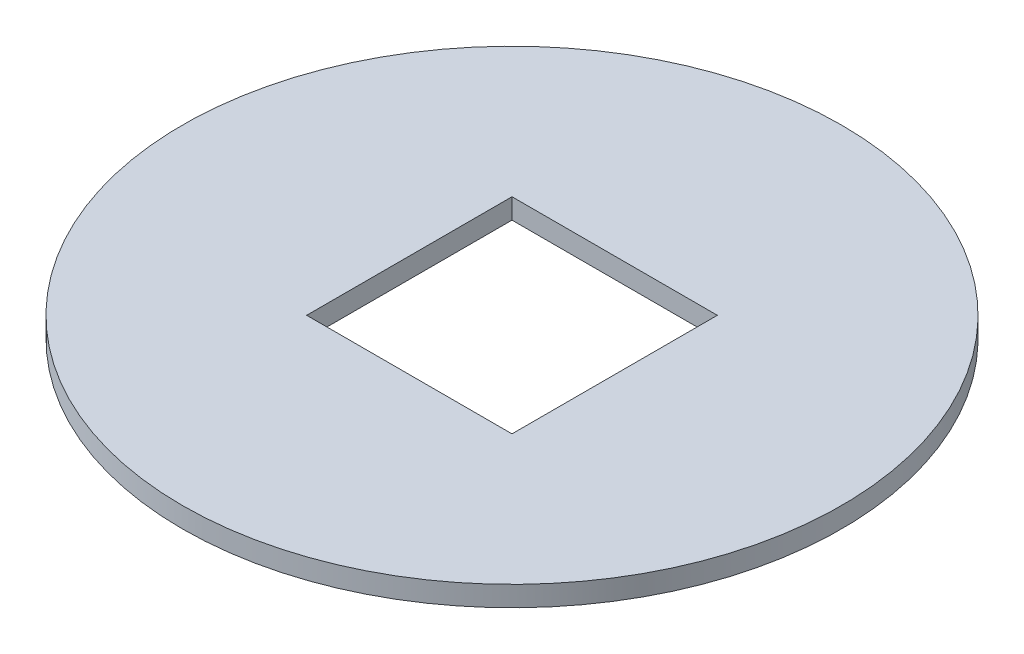
ISO-10303-21;
HEADER;
FILE_DESCRIPTION(('STEP AP214'),'2;1');
FILE_NAME('part.step','',(''),(''),'','','');
FILE_SCHEMA(('AUTOMOTIVE_DESIGN { 1 0 10303 214 1 1 1 1 }'));
ENDSEC;
DATA;
#1=APPLICATION_CONTEXT('core data for automotive mechanical design processes');
#2=APPLICATION_PROTOCOL_DEFINITION('international standard','automotive_design',2000,#1);
#3=PRODUCT_CONTEXT('',#1,'mechanical');
#4=PRODUCT('Part','Part','',(#3));
#5=PRODUCT_RELATED_PRODUCT_CATEGORY('part','',(#4));
#6=PRODUCT_DEFINITION_FORMATION('','',#4);
#7=PRODUCT_DEFINITION_CONTEXT('part definition',#1,'design');
#8=PRODUCT_DEFINITION('design','',#6,#7);
#9=PRODUCT_DEFINITION_SHAPE('','',#8);
#10=(LENGTH_UNIT() NAMED_UNIT(*) SI_UNIT(.MILLI.,.METRE.));
#11=(NAMED_UNIT(*) PLANE_ANGLE_UNIT() SI_UNIT($,.RADIAN.));
#12=(NAMED_UNIT(*) SI_UNIT($,.STERADIAN.) SOLID_ANGLE_UNIT());
#13=UNCERTAINTY_MEASURE_WITH_UNIT(LENGTH_MEASURE(1.E-05),#10,'distance_accuracy_value','');
#14=(GEOMETRIC_REPRESENTATION_CONTEXT(3) GLOBAL_UNCERTAINTY_ASSIGNED_CONTEXT((#13)) GLOBAL_UNIT_ASSIGNED_CONTEXT((#10,
#11,#12)) REPRESENTATION_CONTEXT('',''));
#15=CARTESIAN_POINT('',(0.,0.,0.));
#16=DIRECTION('',(0.,0.,1.));
#17=DIRECTION('',(1.,0.,0.));
#18=AXIS2_PLACEMENT_3D('',#15,#16,#17);
#19=CARTESIAN_POINT('',(172.,-198.124552093904,270.));
#20=DIRECTION('',(0.,-1.,0.));
#21=DIRECTION('',(0.,0.,-1.));
#22=AXIS2_PLACEMENT_3D('',#19,#20,#21);
#23=CYLINDRICAL_SURFACE('',#22,65.);
#24=CARTESIAN_POINT('',(172.,-198.124552093904,270.));
#25=DIRECTION('',(0.,1.,0.));
#26=DIRECTION('',(0.,0.,1.));
#27=AXIS2_PLACEMENT_3D('',#24,#25,#26);
#28=CIRCLE('',#27,65.);
#29=CARTESIAN_POINT('',(172.,-198.124552093904,335.));
#30=VERTEX_POINT('',#29);
#31=EDGE_CURVE('E119',#30,#30,#28,.T.);
#32=ORIENTED_EDGE('',*,*,#31,.F.);
#33=EDGE_LOOP('',(#32));
#34=FACE_BOUND('',#33,.T.);
#35=CARTESIAN_POINT('',(172.,-202.124552093904,270.));
#36=DIRECTION('',(0.,1.,0.));
#37=DIRECTION('',(0.,0.,1.));
#38=AXIS2_PLACEMENT_3D('',#35,#36,#37);
#39=CIRCLE('',#38,65.);
#40=CARTESIAN_POINT('',(172.,-202.124552093904,335.));
#41=VERTEX_POINT('',#40);
#42=EDGE_CURVE('E116',#41,#41,#39,.T.);
#43=ORIENTED_EDGE('',*,*,#42,.T.);
#44=EDGE_LOOP('',(#43));
#45=FACE_BOUND('',#44,.T.);
#46=ADVANCED_FACE('F50',(#34,#45),#23,.T.);
#47=CARTESIAN_POINT('',(172.,-198.124552093904,270.));
#48=DIRECTION('',(0.,1.,0.));
#49=DIRECTION('',(0.,0.,1.));
#50=AXIS2_PLACEMENT_3D('',#47,#48,#49);
#51=PLANE('',#50);
#52=DIRECTION('',(0.,0.,1.));
#53=VECTOR('',#52,1.);
#54=CARTESIAN_POINT('',(151.75,-198.124552093904,290.25));
#55=LINE('',#54,#53);
#56=CARTESIAN_POINT('',(151.75,-198.124552093904,249.75));
#57=VERTEX_POINT('',#56);
#58=CARTESIAN_POINT('',(151.75,-198.124552093904,290.25));
#59=VERTEX_POINT('',#58);
#60=EDGE_CURVE('E64',#57,#59,#55,.T.);
#61=ORIENTED_EDGE('',*,*,#60,.F.);
#62=DIRECTION('',(-1.,0.,0.));
#63=VECTOR('',#62,1.);
#64=CARTESIAN_POINT('',(192.25,-198.124552093904,249.75));
#65=LINE('',#64,#63);
#66=CARTESIAN_POINT('',(192.25,-198.124552093904,249.75));
#67=VERTEX_POINT('',#66);
#68=EDGE_CURVE('E109',#67,#57,#65,.T.);
#69=ORIENTED_EDGE('',*,*,#68,.F.);
#70=DIRECTION('',(0.,0.,-1.));
#71=VECTOR('',#70,1.);
#72=CARTESIAN_POINT('',(192.25,-198.124552093904,290.25));
#73=LINE('',#72,#71);
#74=CARTESIAN_POINT('',(192.25,-198.124552093904,290.25));
#75=VERTEX_POINT('',#74);
#76=EDGE_CURVE('E93',#75,#67,#73,.T.);
#77=ORIENTED_EDGE('',*,*,#76,.F.);
#78=DIRECTION('',(1.,0.,0.));
#79=VECTOR('',#78,1.);
#80=CARTESIAN_POINT('',(192.25,-198.124552093904,290.25));
#81=LINE('',#80,#79);
#82=EDGE_CURVE('E102',#59,#75,#81,.T.);
#83=ORIENTED_EDGE('',*,*,#82,.F.);
#84=EDGE_LOOP('',(#61,#69,#77,#83));
#85=FACE_BOUND('',#84,.T.);
#86=ORIENTED_EDGE('',*,*,#31,.T.);
#87=EDGE_LOOP('',(#86));
#88=FACE_BOUND('',#87,.T.);
#89=ADVANCED_FACE('F106',(#85,#88),#51,.T.);
#90=CARTESIAN_POINT('',(172.,-202.124552093904,270.));
#91=DIRECTION('',(0.,1.,0.));
#92=DIRECTION('',(0.,0.,1.));
#93=AXIS2_PLACEMENT_3D('',#90,#91,#92);
#94=PLANE('',#93);
#95=DIRECTION('',(-1.,0.,0.));
#96=VECTOR('',#95,1.);
#97=CARTESIAN_POINT('',(172.,-202.124552093904,249.75));
#98=LINE('',#97,#96);
#99=CARTESIAN_POINT('',(192.25,-202.124552093904,249.75));
#100=VERTEX_POINT('',#99);
#101=CARTESIAN_POINT('',(151.75,-202.124552093904,249.75));
#102=VERTEX_POINT('',#101);
#103=EDGE_CURVE('E57',#100,#102,#98,.T.);
#104=ORIENTED_EDGE('',*,*,#103,.T.);
#105=DIRECTION('',(0.,0.,1.));
#106=VECTOR('',#105,1.);
#107=CARTESIAN_POINT('',(151.75,-202.124552093904,270.));
#108=LINE('',#107,#106);
#109=CARTESIAN_POINT('',(151.75,-202.124552093904,290.25));
#110=VERTEX_POINT('',#109);
#111=EDGE_CURVE('E13',#102,#110,#108,.T.);
#112=ORIENTED_EDGE('',*,*,#111,.T.);
#113=DIRECTION('',(1.,0.,0.));
#114=VECTOR('',#113,1.);
#115=CARTESIAN_POINT('',(172.,-202.124552093904,290.25));
#116=LINE('',#115,#114);
#117=CARTESIAN_POINT('',(192.25,-202.124552093904,290.25));
#118=VERTEX_POINT('',#117);
#119=EDGE_CURVE('E122',#110,#118,#116,.T.);
#120=ORIENTED_EDGE('',*,*,#119,.T.);
#121=DIRECTION('',(0.,0.,-1.));
#122=VECTOR('',#121,1.);
#123=CARTESIAN_POINT('',(192.25,-202.124552093904,270.));
#124=LINE('',#123,#122);
#125=EDGE_CURVE('E96',#118,#100,#124,.T.);
#126=ORIENTED_EDGE('',*,*,#125,.T.);
#127=EDGE_LOOP('',(#104,#112,#120,#126));
#128=FACE_BOUND('',#127,.T.);
#129=ORIENTED_EDGE('',*,*,#42,.F.);
#130=EDGE_LOOP('',(#129));
#131=FACE_BOUND('',#130,.T.);
#132=ADVANCED_FACE('F128',(#128,#131),#94,.F.);
#133=CARTESIAN_POINT('',(151.75,-204.124552093904,290.25));
#134=DIRECTION('',(-1.,0.,0.));
#135=DIRECTION('',(0.,0.,1.));
#136=AXIS2_PLACEMENT_3D('',#133,#134,#135);
#137=PLANE('',#136);
#138=DIRECTION('',(0.,1.,0.));
#139=VECTOR('',#138,1.);
#140=CARTESIAN_POINT('',(151.75,-204.124552093904,249.75));
#141=LINE('',#140,#139);
#142=EDGE_CURVE('E114',#102,#57,#141,.T.);
#143=ORIENTED_EDGE('',*,*,#142,.T.);
#144=ORIENTED_EDGE('',*,*,#60,.T.);
#145=DIRECTION('',(0.,1.,0.));
#146=VECTOR('',#145,1.);
#147=CARTESIAN_POINT('',(151.75,-204.124552093904,290.25));
#148=LINE('',#147,#146);
#149=EDGE_CURVE('E99',#110,#59,#148,.T.);
#150=ORIENTED_EDGE('',*,*,#149,.F.);
#151=ORIENTED_EDGE('',*,*,#111,.F.);
#152=EDGE_LOOP('',(#143,#144,#150,#151));
#153=FACE_BOUND('',#152,.T.);
#154=ADVANCED_FACE('F133',(#153),#137,.F.);
#155=CARTESIAN_POINT('',(192.25,-204.124552093904,249.75));
#156=DIRECTION('',(0.,0.,-1.));
#157=DIRECTION('',(-1.,0.,0.));
#158=AXIS2_PLACEMENT_3D('',#155,#156,#157);
#159=PLANE('',#158);
#160=DIRECTION('',(0.,1.,0.));
#161=VECTOR('',#160,1.);
#162=CARTESIAN_POINT('',(192.25,-204.124552093904,249.75));
#163=LINE('',#162,#161);
#164=EDGE_CURVE('E98',#100,#67,#163,.T.);
#165=ORIENTED_EDGE('',*,*,#164,.T.);
#166=ORIENTED_EDGE('',*,*,#68,.T.);
#167=ORIENTED_EDGE('',*,*,#142,.F.);
#168=ORIENTED_EDGE('',*,*,#103,.F.);
#169=EDGE_LOOP('',(#165,#166,#167,#168));
#170=FACE_BOUND('',#169,.T.);
#171=ADVANCED_FACE('F132',(#170),#159,.F.);
#172=CARTESIAN_POINT('',(192.25,-204.124552093904,290.25));
#173=DIRECTION('',(1.,0.,0.));
#174=DIRECTION('',(0.,0.,-1.));
#175=AXIS2_PLACEMENT_3D('',#172,#173,#174);
#176=PLANE('',#175);
#177=DIRECTION('',(0.,1.,0.));
#178=VECTOR('',#177,1.);
#179=CARTESIAN_POINT('',(192.25,-204.124552093904,290.25));
#180=LINE('',#179,#178);
#181=EDGE_CURVE('E72',#118,#75,#180,.T.);
#182=ORIENTED_EDGE('',*,*,#181,.T.);
#183=ORIENTED_EDGE('',*,*,#76,.T.);
#184=ORIENTED_EDGE('',*,*,#164,.F.);
#185=ORIENTED_EDGE('',*,*,#125,.F.);
#186=EDGE_LOOP('',(#182,#183,#184,#185));
#187=FACE_BOUND('',#186,.T.);
#188=ADVANCED_FACE('F90',(#187),#176,.F.);
#189=CARTESIAN_POINT('',(192.25,-204.124552093904,290.25));
#190=DIRECTION('',(0.,0.,1.));
#191=DIRECTION('',(1.,0.,0.));
#192=AXIS2_PLACEMENT_3D('',#189,#190,#191);
#193=PLANE('',#192);
#194=ORIENTED_EDGE('',*,*,#149,.T.);
#195=ORIENTED_EDGE('',*,*,#82,.T.);
#196=ORIENTED_EDGE('',*,*,#181,.F.);
#197=ORIENTED_EDGE('',*,*,#119,.F.);
#198=EDGE_LOOP('',(#194,#195,#196,#197));
#199=FACE_BOUND('',#198,.T.);
#200=ADVANCED_FACE('F103',(#199),#193,.F.);
#201=CLOSED_SHELL('',(#46,#89,#132,#154,#171,#188,#200));
#202=MANIFOLD_SOLID_BREP('B2',#201);
#203=ADVANCED_BREP_SHAPE_REPRESENTATION('',(#18,#202),#14);
#204=SHAPE_DEFINITION_REPRESENTATION(#9,#203);
ENDSEC;
END-ISO-10303-21;
